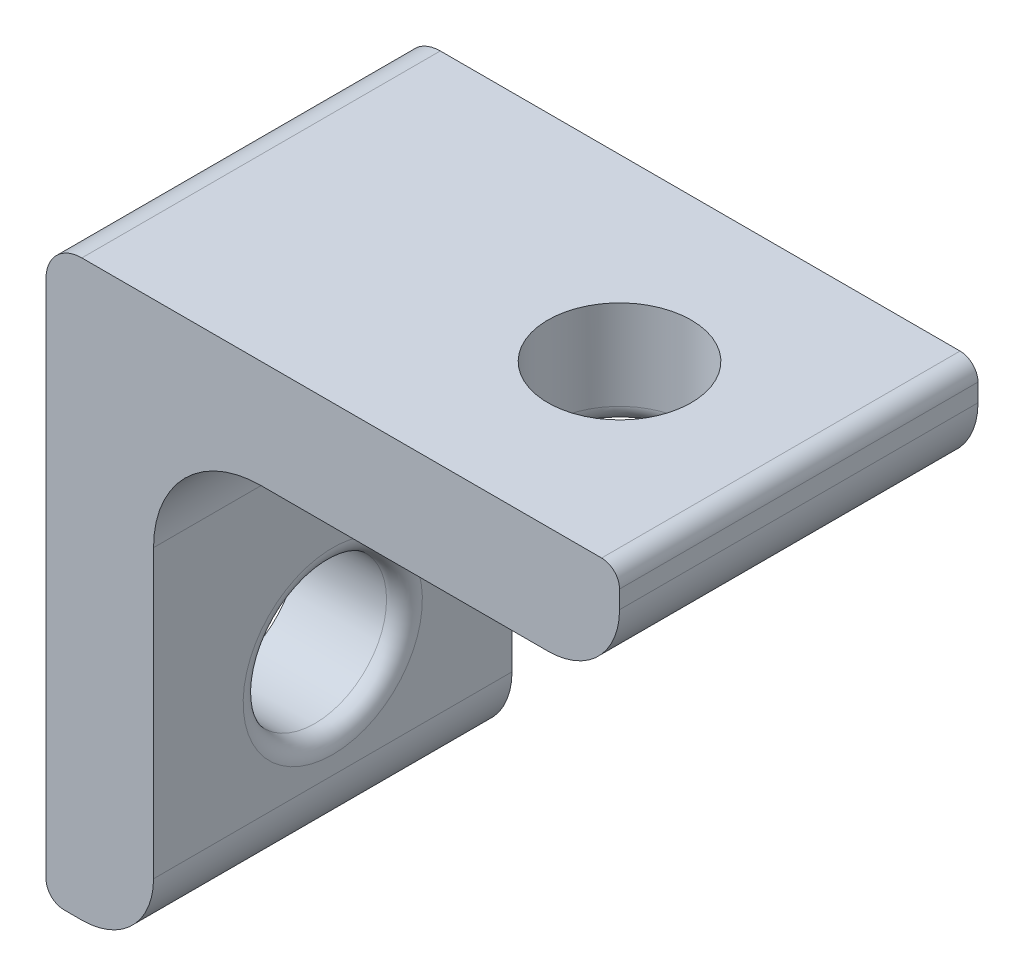
ISO-10303-21;
HEADER;
FILE_DESCRIPTION(('STEP AP214'),'2;1');
FILE_NAME('part.step','',(''),(''),'','','');
FILE_SCHEMA(('AUTOMOTIVE_DESIGN { 1 0 10303 214 1 1 1 1 }'));
ENDSEC;
DATA;
#1=APPLICATION_CONTEXT('core data for automotive mechanical design processes');
#2=APPLICATION_PROTOCOL_DEFINITION('international standard','automotive_design',2000,#1);
#3=PRODUCT_CONTEXT('',#1,'mechanical');
#4=PRODUCT('Part','Part','',(#3));
#5=PRODUCT_RELATED_PRODUCT_CATEGORY('part','',(#4));
#6=PRODUCT_DEFINITION_FORMATION('','',#4);
#7=PRODUCT_DEFINITION_CONTEXT('part definition',#1,'design');
#8=PRODUCT_DEFINITION('design','',#6,#7);
#9=PRODUCT_DEFINITION_SHAPE('','',#8);
#10=(LENGTH_UNIT() NAMED_UNIT(*) SI_UNIT(.MILLI.,.METRE.));
#11=(NAMED_UNIT(*) PLANE_ANGLE_UNIT() SI_UNIT($,.RADIAN.));
#12=(NAMED_UNIT(*) SI_UNIT($,.STERADIAN.) SOLID_ANGLE_UNIT());
#13=UNCERTAINTY_MEASURE_WITH_UNIT(LENGTH_MEASURE(1.E-05),#10,'distance_accuracy_value','');
#14=(GEOMETRIC_REPRESENTATION_CONTEXT(3) GLOBAL_UNCERTAINTY_ASSIGNED_CONTEXT((#13)) GLOBAL_UNIT_ASSIGNED_CONTEXT((#10,
#11,#12)) REPRESENTATION_CONTEXT('',''));
#15=CARTESIAN_POINT('',(0.,0.,0.));
#16=DIRECTION('',(0.,0.,1.));
#17=DIRECTION('',(1.,0.,0.));
#18=AXIS2_PLACEMENT_3D('',#15,#16,#17);
#19=CARTESIAN_POINT('',(-15.5,-12.5,10.));
#20=DIRECTION('',(0.,0.,-1.));
#21=DIRECTION('',(-1.,0.,0.));
#22=AXIS2_PLACEMENT_3D('',#19,#20,#21);
#23=CYLINDRICAL_SURFACE('',#22,0.500000000000001);
#24=CARTESIAN_POINT('',(-15.5,-12.5,0.));
#25=DIRECTION('',(0.,0.,1.));
#26=DIRECTION('',(1.,0.,0.));
#27=AXIS2_PLACEMENT_3D('',#24,#25,#26);
#28=CIRCLE('',#27,0.500000000000001);
#29=CARTESIAN_POINT('',(-16.,-12.5,0.));
#30=VERTEX_POINT('',#29);
#31=CARTESIAN_POINT('',(-15.5,-13.,0.));
#32=VERTEX_POINT('',#31);
#33=EDGE_CURVE('E154',#30,#32,#28,.T.);
#34=ORIENTED_EDGE('',*,*,#33,.T.);
#35=DIRECTION('',(0.,0.,-1.));
#36=VECTOR('',#35,1.);
#37=CARTESIAN_POINT('',(-15.5,-13.,10.));
#38=LINE('',#37,#36);
#39=CARTESIAN_POINT('',(-15.5,-13.,10.));
#40=VERTEX_POINT('',#39);
#41=EDGE_CURVE('E135',#40,#32,#38,.T.);
#42=ORIENTED_EDGE('',*,*,#41,.F.);
#43=CARTESIAN_POINT('',(-15.5,-12.5,10.));
#44=DIRECTION('',(0.,0.,1.));
#45=DIRECTION('',(1.,0.,0.));
#46=AXIS2_PLACEMENT_3D('',#43,#44,#45);
#47=CIRCLE('',#46,0.500000000000001);
#48=CARTESIAN_POINT('',(-16.,-12.5,10.));
#49=VERTEX_POINT('',#48);
#50=EDGE_CURVE('E142',#49,#40,#47,.T.);
#51=ORIENTED_EDGE('',*,*,#50,.F.);
#52=DIRECTION('',(0.,0.,-1.));
#53=VECTOR('',#52,1.);
#54=CARTESIAN_POINT('',(-16.,-12.5,10.));
#55=LINE('',#54,#53);
#56=EDGE_CURVE('E202',#49,#30,#55,.T.);
#57=ORIENTED_EDGE('',*,*,#56,.T.);
#58=EDGE_LOOP('',(#34,#42,#51,#57));
#59=FACE_BOUND('',#58,.T.);
#60=ADVANCED_FACE('F42',(#59),#23,.T.);
#61=CARTESIAN_POINT('',(-15.,-13.,10.));
#62=DIRECTION('',(0.,1.,0.));
#63=DIRECTION('',(-1.,0.,0.));
#64=AXIS2_PLACEMENT_3D('',#61,#62,#63);
#65=PLANE('',#64);
#66=DIRECTION('',(1.,0.,0.));
#67=VECTOR('',#66,1.);
#68=CARTESIAN_POINT('',(-15.,-13.,0.));
#69=LINE('',#68,#67);
#70=CARTESIAN_POINT('',(-15.,-13.,0.));
#71=VERTEX_POINT('',#70);
#72=EDGE_CURVE('E234',#32,#71,#69,.T.);
#73=ORIENTED_EDGE('',*,*,#72,.T.);
#74=DIRECTION('',(0.,0.,-1.));
#75=VECTOR('',#74,1.);
#76=CARTESIAN_POINT('',(-15.,-13.,10.));
#77=LINE('',#76,#75);
#78=CARTESIAN_POINT('',(-15.,-13.,10.));
#79=VERTEX_POINT('',#78);
#80=EDGE_CURVE('E138',#79,#71,#77,.T.);
#81=ORIENTED_EDGE('',*,*,#80,.F.);
#82=DIRECTION('',(1.,0.,0.));
#83=VECTOR('',#82,1.);
#84=CARTESIAN_POINT('',(-15.,-13.,10.));
#85=LINE('',#84,#83);
#86=EDGE_CURVE('E131',#40,#79,#85,.T.);
#87=ORIENTED_EDGE('',*,*,#86,.F.);
#88=ORIENTED_EDGE('',*,*,#41,.T.);
#89=EDGE_LOOP('',(#73,#81,#87,#88));
#90=FACE_BOUND('',#89,.T.);
#91=ADVANCED_FACE('F133',(#90),#65,.F.);
#92=CARTESIAN_POINT('',(-15.,-11.,10.));
#93=DIRECTION('',(0.,0.,-1.));
#94=DIRECTION('',(-1.,0.,0.));
#95=AXIS2_PLACEMENT_3D('',#92,#93,#94);
#96=CYLINDRICAL_SURFACE('',#95,2.);
#97=CARTESIAN_POINT('',(-15.,-11.,0.));
#98=DIRECTION('',(0.,0.,1.));
#99=DIRECTION('',(-1.,0.,0.));
#100=AXIS2_PLACEMENT_3D('',#97,#98,#99);
#101=CIRCLE('',#100,2.);
#102=CARTESIAN_POINT('',(-13.,-11.,0.));
#103=VERTEX_POINT('',#102);
#104=EDGE_CURVE('E228',#71,#103,#101,.T.);
#105=ORIENTED_EDGE('',*,*,#104,.T.);
#106=DIRECTION('',(0.,0.,-1.));
#107=VECTOR('',#106,1.);
#108=CARTESIAN_POINT('',(-13.,-11.,10.));
#109=LINE('',#108,#107);
#110=CARTESIAN_POINT('',(-13.,-11.,10.));
#111=VERTEX_POINT('',#110);
#112=EDGE_CURVE('E160',#111,#103,#109,.T.);
#113=ORIENTED_EDGE('',*,*,#112,.F.);
#114=CARTESIAN_POINT('',(-15.,-11.,10.));
#115=DIRECTION('',(0.,0.,1.));
#116=DIRECTION('',(-1.,0.,0.));
#117=AXIS2_PLACEMENT_3D('',#114,#115,#116);
#118=CIRCLE('',#117,2.);
#119=EDGE_CURVE('E141',#79,#111,#118,.T.);
#120=ORIENTED_EDGE('',*,*,#119,.F.);
#121=ORIENTED_EDGE('',*,*,#80,.T.);
#122=EDGE_LOOP('',(#105,#113,#120,#121));
#123=FACE_BOUND('',#122,.T.);
#124=ADVANCED_FACE('F256',(#123),#96,.T.);
#125=CARTESIAN_POINT('',(-13.,0.,10.));
#126=DIRECTION('',(-1.,0.,0.));
#127=DIRECTION('',(0.,-1.,0.));
#128=AXIS2_PLACEMENT_3D('',#125,#126,#127);
#129=PLANE('',#128);
#130=CARTESIAN_POINT('',(-13.,-8.00000000000001,5.));
#131=DIRECTION('',(-1.,0.,0.));
#132=DIRECTION('',(0.,-1.,0.));
#133=AXIS2_PLACEMENT_3D('',#130,#131,#132);
#134=CIRCLE('',#133,2.5);
#135=CARTESIAN_POINT('',(-13.,-10.5,5.));
#136=VERTEX_POINT('',#135);
#137=EDGE_CURVE('E175',#136,#136,#134,.T.);
#138=ORIENTED_EDGE('',*,*,#137,.T.);
#139=EDGE_LOOP('',(#138));
#140=FACE_BOUND('',#139,.T.);
#141=DIRECTION('',(0.,1.,0.));
#142=VECTOR('',#141,1.);
#143=CARTESIAN_POINT('',(-13.,0.,0.));
#144=LINE('',#143,#142);
#145=CARTESIAN_POINT('',(-13.,-3.,0.));
#146=VERTEX_POINT('',#145);
#147=EDGE_CURVE('E222',#103,#146,#144,.T.);
#148=ORIENTED_EDGE('',*,*,#147,.T.);
#149=DIRECTION('',(0.,0.,-1.));
#150=VECTOR('',#149,1.);
#151=CARTESIAN_POINT('',(-13.,-3.,10.));
#152=LINE('',#151,#150);
#153=CARTESIAN_POINT('',(-13.,-3.,10.));
#154=VERTEX_POINT('',#153);
#155=EDGE_CURVE('E181',#146,#154,#152,.F.);
#156=ORIENTED_EDGE('',*,*,#155,.T.);
#157=DIRECTION('',(0.,1.,0.));
#158=VECTOR('',#157,1.);
#159=CARTESIAN_POINT('',(-13.,0.,10.));
#160=LINE('',#159,#158);
#161=EDGE_CURVE('E225',#111,#154,#160,.T.);
#162=ORIENTED_EDGE('',*,*,#161,.F.);
#163=ORIENTED_EDGE('',*,*,#112,.T.);
#164=EDGE_LOOP('',(#148,#156,#162,#163));
#165=FACE_BOUND('',#164,.T.);
#166=ADVANCED_FACE('F221',(#140,#165),#129,.F.);
#167=CARTESIAN_POINT('',(-13.,0.,10.));
#168=DIRECTION('',(0.,1.,0.));
#169=DIRECTION('',(-1.,0.,0.));
#170=AXIS2_PLACEMENT_3D('',#167,#168,#169);
#171=PLANE('',#170);
#172=CARTESIAN_POINT('',(-5.,0.,5.));
#173=DIRECTION('',(0.,1.,0.));
#174=DIRECTION('',(-1.,0.,0.));
#175=AXIS2_PLACEMENT_3D('',#172,#173,#174);
#176=CIRCLE('',#175,2.5);
#177=CARTESIAN_POINT('',(-7.5,0.,5.));
#178=VERTEX_POINT('',#177);
#179=EDGE_CURVE('E155',#178,#178,#176,.T.);
#180=ORIENTED_EDGE('',*,*,#179,.T.);
#181=EDGE_LOOP('',(#180));
#182=FACE_BOUND('',#181,.T.);
#183=DIRECTION('',(1.,0.,0.));
#184=VECTOR('',#183,1.);
#185=CARTESIAN_POINT('',(-13.,0.,10.));
#186=LINE('',#185,#184);
#187=CARTESIAN_POINT('',(-10.,0.,10.));
#188=VERTEX_POINT('',#187);
#189=CARTESIAN_POINT('',(-2.00000000000001,0.,10.));
#190=VERTEX_POINT('',#189);
#191=EDGE_CURVE('E258',#188,#190,#186,.T.);
#192=ORIENTED_EDGE('',*,*,#191,.F.);
#193=DIRECTION('',(0.,0.,-1.));
#194=VECTOR('',#193,1.);
#195=CARTESIAN_POINT('',(-10.,0.,0.));
#196=LINE('',#195,#194);
#197=CARTESIAN_POINT('',(-10.,0.,0.));
#198=VERTEX_POINT('',#197);
#199=EDGE_CURVE('E178',#188,#198,#196,.T.);
#200=ORIENTED_EDGE('',*,*,#199,.T.);
#201=DIRECTION('',(1.,0.,0.));
#202=VECTOR('',#201,1.);
#203=CARTESIAN_POINT('',(-13.,0.,0.));
#204=LINE('',#203,#202);
#205=CARTESIAN_POINT('',(-2.00000000000001,0.,0.));
#206=VERTEX_POINT('',#205);
#207=EDGE_CURVE('E230',#198,#206,#204,.T.);
#208=ORIENTED_EDGE('',*,*,#207,.T.);
#209=DIRECTION('',(0.,0.,-1.));
#210=VECTOR('',#209,1.);
#211=CARTESIAN_POINT('',(-2.00000000000001,0.,10.));
#212=LINE('',#211,#210);
#213=EDGE_CURVE('E213',#190,#206,#212,.T.);
#214=ORIENTED_EDGE('',*,*,#213,.F.);
#215=EDGE_LOOP('',(#192,#200,#208,#214));
#216=FACE_BOUND('',#215,.T.);
#217=ADVANCED_FACE('F274',(#182,#216),#171,.F.);
#218=CARTESIAN_POINT('',(-2.,2.,10.));
#219=DIRECTION('',(0.,0.,-1.));
#220=DIRECTION('',(-1.,0.,0.));
#221=AXIS2_PLACEMENT_3D('',#218,#219,#220);
#222=CYLINDRICAL_SURFACE('',#221,2.);
#223=CARTESIAN_POINT('',(-2.,2.,0.));
#224=DIRECTION('',(0.,0.,1.));
#225=DIRECTION('',(-1.,0.,0.));
#226=AXIS2_PLACEMENT_3D('',#223,#224,#225);
#227=CIRCLE('',#226,2.);
#228=CARTESIAN_POINT('',(0.,2.00000000000001,0.));
#229=VERTEX_POINT('',#228);
#230=EDGE_CURVE('E232',#206,#229,#227,.T.);
#231=ORIENTED_EDGE('',*,*,#230,.T.);
#232=DIRECTION('',(0.,0.,-1.));
#233=VECTOR('',#232,1.);
#234=CARTESIAN_POINT('',(0.,2.00000000000001,10.));
#235=LINE('',#234,#233);
#236=CARTESIAN_POINT('',(0.,2.00000000000001,10.));
#237=VERTEX_POINT('',#236);
#238=EDGE_CURVE('E210',#237,#229,#235,.T.);
#239=ORIENTED_EDGE('',*,*,#238,.F.);
#240=CARTESIAN_POINT('',(-2.,2.,10.));
#241=DIRECTION('',(0.,0.,1.));
#242=DIRECTION('',(-1.,0.,0.));
#243=AXIS2_PLACEMENT_3D('',#240,#241,#242);
#244=CIRCLE('',#243,2.);
#245=EDGE_CURVE('E262',#190,#237,#244,.T.);
#246=ORIENTED_EDGE('',*,*,#245,.F.);
#247=ORIENTED_EDGE('',*,*,#213,.T.);
#248=EDGE_LOOP('',(#231,#239,#246,#247));
#249=FACE_BOUND('',#248,.T.);
#250=ADVANCED_FACE('F270',(#249),#222,.T.);
#251=CARTESIAN_POINT('',(0.,2.49999999999999,10.));
#252=DIRECTION('',(-1.,0.,0.));
#253=DIRECTION('',(0.,0.,1.));
#254=AXIS2_PLACEMENT_3D('',#251,#252,#253);
#255=PLANE('',#254);
#256=DIRECTION('',(0.,1.,0.));
#257=VECTOR('',#256,1.);
#258=CARTESIAN_POINT('',(0.,2.49999999999999,0.));
#259=LINE('',#258,#257);
#260=CARTESIAN_POINT('',(0.,2.49999999999999,0.));
#261=VERTEX_POINT('',#260);
#262=EDGE_CURVE('E239',#229,#261,#259,.T.);
#263=ORIENTED_EDGE('',*,*,#262,.T.);
#264=DIRECTION('',(0.,0.,-1.));
#265=VECTOR('',#264,1.);
#266=CARTESIAN_POINT('',(0.,2.49999999999999,10.));
#267=LINE('',#266,#265);
#268=CARTESIAN_POINT('',(0.,2.49999999999999,10.));
#269=VERTEX_POINT('',#268);
#270=EDGE_CURVE('E207',#269,#261,#267,.T.);
#271=ORIENTED_EDGE('',*,*,#270,.F.);
#272=DIRECTION('',(0.,1.,0.));
#273=VECTOR('',#272,1.);
#274=CARTESIAN_POINT('',(0.,2.49999999999999,10.));
#275=LINE('',#274,#273);
#276=EDGE_CURVE('E252',#237,#269,#275,.T.);
#277=ORIENTED_EDGE('',*,*,#276,.F.);
#278=ORIENTED_EDGE('',*,*,#238,.T.);
#279=EDGE_LOOP('',(#263,#271,#277,#278));
#280=FACE_BOUND('',#279,.T.);
#281=ADVANCED_FACE('F267',(#280),#255,.F.);
#282=CARTESIAN_POINT('',(-0.5,2.5,10.));
#283=DIRECTION('',(0.,0.,-1.));
#284=DIRECTION('',(-1.,0.,0.));
#285=AXIS2_PLACEMENT_3D('',#282,#283,#284);
#286=CYLINDRICAL_SURFACE('',#285,0.5);
#287=CARTESIAN_POINT('',(-0.5,2.5,0.));
#288=DIRECTION('',(0.,0.,1.));
#289=DIRECTION('',(1.,0.,0.));
#290=AXIS2_PLACEMENT_3D('',#287,#288,#289);
#291=CIRCLE('',#290,0.5);
#292=CARTESIAN_POINT('',(-0.500000000000004,3.,0.));
#293=VERTEX_POINT('',#292);
#294=EDGE_CURVE('E198',#261,#293,#291,.T.);
#295=ORIENTED_EDGE('',*,*,#294,.T.);
#296=DIRECTION('',(0.,0.,-1.));
#297=VECTOR('',#296,1.);
#298=CARTESIAN_POINT('',(-0.500000000000004,3.,10.));
#299=LINE('',#298,#297);
#300=CARTESIAN_POINT('',(-0.500000000000004,3.,10.));
#301=VERTEX_POINT('',#300);
#302=EDGE_CURVE('E204',#301,#293,#299,.T.);
#303=ORIENTED_EDGE('',*,*,#302,.F.);
#304=CARTESIAN_POINT('',(-0.5,2.5,10.));
#305=DIRECTION('',(0.,0.,1.));
#306=DIRECTION('',(1.,0.,0.));
#307=AXIS2_PLACEMENT_3D('',#304,#305,#306);
#308=CIRCLE('',#307,0.5);
#309=EDGE_CURVE('E249',#269,#301,#308,.T.);
#310=ORIENTED_EDGE('',*,*,#309,.F.);
#311=ORIENTED_EDGE('',*,*,#270,.T.);
#312=EDGE_LOOP('',(#295,#303,#310,#311));
#313=FACE_BOUND('',#312,.T.);
#314=ADVANCED_FACE('F243',(#313),#286,.T.);
#315=CARTESIAN_POINT('',(-16.,3.,10.));
#316=DIRECTION('',(0.,-1.,0.));
#317=DIRECTION('',(0.,0.,-1.));
#318=AXIS2_PLACEMENT_3D('',#315,#316,#317);
#319=PLANE('',#318);
#320=CARTESIAN_POINT('',(-5.,3.,5.));
#321=DIRECTION('',(0.,-1.,0.));
#322=DIRECTION('',(0.,0.,-1.));
#323=AXIS2_PLACEMENT_3D('',#320,#321,#322);
#324=CIRCLE('',#323,2.);
#325=CARTESIAN_POINT('',(-5.,3.,3.));
#326=VERTEX_POINT('',#325);
#327=EDGE_CURVE('E164',#326,#326,#324,.F.);
#328=ORIENTED_EDGE('',*,*,#327,.F.);
#329=EDGE_LOOP('',(#328));
#330=FACE_BOUND('',#329,.T.);
#331=DIRECTION('',(-1.,0.,0.));
#332=VECTOR('',#331,1.);
#333=CARTESIAN_POINT('',(-16.,3.,0.));
#334=LINE('',#333,#332);
#335=CARTESIAN_POINT('',(-15.,3.,0.));
#336=VERTEX_POINT('',#335);
#337=EDGE_CURVE('E196',#293,#336,#334,.T.);
#338=ORIENTED_EDGE('',*,*,#337,.T.);
#339=DIRECTION('',(0.,0.,-1.));
#340=VECTOR('',#339,1.);
#341=CARTESIAN_POINT('',(-15.,3.,10.));
#342=LINE('',#341,#340);
#343=CARTESIAN_POINT('',(-15.,3.,10.));
#344=VERTEX_POINT('',#343);
#345=EDGE_CURVE('E50',#336,#344,#342,.F.);
#346=ORIENTED_EDGE('',*,*,#345,.T.);
#347=DIRECTION('',(-1.,0.,0.));
#348=VECTOR('',#347,1.);
#349=CARTESIAN_POINT('',(-16.,3.,10.));
#350=LINE('',#349,#348);
#351=EDGE_CURVE('E248',#301,#344,#350,.T.);
#352=ORIENTED_EDGE('',*,*,#351,.F.);
#353=ORIENTED_EDGE('',*,*,#302,.T.);
#354=EDGE_LOOP('',(#338,#346,#352,#353));
#355=FACE_BOUND('',#354,.T.);
#356=ADVANCED_FACE('F247',(#330,#355),#319,.F.);
#357=CARTESIAN_POINT('',(-16.,-12.5,10.));
#358=DIRECTION('',(1.,0.,0.));
#359=DIRECTION('',(0.,0.,-1.));
#360=AXIS2_PLACEMENT_3D('',#357,#358,#359);
#361=PLANE('',#360);
#362=CARTESIAN_POINT('',(-16.,-8.00000000000001,5.));
#363=DIRECTION('',(1.,0.,0.));
#364=DIRECTION('',(0.,0.,-1.));
#365=AXIS2_PLACEMENT_3D('',#362,#363,#364);
#366=CIRCLE('',#365,2.);
#367=CARTESIAN_POINT('',(-16.,-8.00000000000001,3.));
#368=VERTEX_POINT('',#367);
#369=EDGE_CURVE('E167',#368,#368,#366,.T.);
#370=ORIENTED_EDGE('',*,*,#369,.T.);
#371=EDGE_LOOP('',(#370));
#372=FACE_BOUND('',#371,.T.);
#373=DIRECTION('',(0.,-1.,0.));
#374=VECTOR('',#373,1.);
#375=CARTESIAN_POINT('',(-16.,-12.5,10.));
#376=LINE('',#375,#374);
#377=CARTESIAN_POINT('',(-16.,2.,10.));
#378=VERTEX_POINT('',#377);
#379=EDGE_CURVE('E147',#378,#49,#376,.T.);
#380=ORIENTED_EDGE('',*,*,#379,.F.);
#381=DIRECTION('',(0.,0.,-1.));
#382=VECTOR('',#381,1.);
#383=CARTESIAN_POINT('',(-16.,2.,10.));
#384=LINE('',#383,#382);
#385=CARTESIAN_POINT('',(-16.,2.,0.));
#386=VERTEX_POINT('',#385);
#387=EDGE_CURVE('E187',#378,#386,#384,.T.);
#388=ORIENTED_EDGE('',*,*,#387,.T.);
#389=DIRECTION('',(0.,-1.,0.));
#390=VECTOR('',#389,1.);
#391=CARTESIAN_POINT('',(-16.,-12.5,0.));
#392=LINE('',#391,#390);
#393=EDGE_CURVE('E151',#386,#30,#392,.T.);
#394=ORIENTED_EDGE('',*,*,#393,.T.);
#395=ORIENTED_EDGE('',*,*,#56,.F.);
#396=EDGE_LOOP('',(#380,#388,#394,#395));
#397=FACE_BOUND('',#396,.T.);
#398=ADVANCED_FACE('F192',(#372,#397),#361,.F.);
#399=CARTESIAN_POINT('',(-15.5,-12.5,10.));
#400=DIRECTION('',(0.,0.,1.));
#401=DIRECTION('',(1.,0.,0.));
#402=AXIS2_PLACEMENT_3D('',#399,#400,#401);
#403=PLANE('',#402);
#404=ORIENTED_EDGE('',*,*,#351,.T.);
#405=CARTESIAN_POINT('',(-15.,2.,10.));
#406=DIRECTION('',(0.,0.,1.));
#407=DIRECTION('',(1.,0.,0.));
#408=AXIS2_PLACEMENT_3D('',#405,#406,#407);
#409=CIRCLE('',#408,1.);
#410=EDGE_CURVE('E12',#344,#378,#409,.T.);
#411=ORIENTED_EDGE('',*,*,#410,.T.);
#412=ORIENTED_EDGE('',*,*,#379,.T.);
#413=ORIENTED_EDGE('',*,*,#50,.T.);
#414=ORIENTED_EDGE('',*,*,#86,.T.);
#415=ORIENTED_EDGE('',*,*,#119,.T.);
#416=ORIENTED_EDGE('',*,*,#161,.T.);
#417=CARTESIAN_POINT('',(-10.,-3.,10.));
#418=DIRECTION('',(0.,0.,1.));
#419=DIRECTION('',(1.,0.,0.));
#420=AXIS2_PLACEMENT_3D('',#417,#418,#419);
#421=CIRCLE('',#420,3.);
#422=EDGE_CURVE('E185',#154,#188,#421,.F.);
#423=ORIENTED_EDGE('',*,*,#422,.T.);
#424=ORIENTED_EDGE('',*,*,#191,.T.);
#425=ORIENTED_EDGE('',*,*,#245,.T.);
#426=ORIENTED_EDGE('',*,*,#276,.T.);
#427=ORIENTED_EDGE('',*,*,#309,.T.);
#428=EDGE_LOOP('',(#404,#411,#412,#413,#414,#415,#416,#423,#424,#425,#426,#427));
#429=FACE_BOUND('',#428,.T.);
#430=ADVANCED_FACE('F145',(#429),#403,.T.);
#431=CARTESIAN_POINT('',(-15.5,-12.5,0.));
#432=DIRECTION('',(0.,0.,1.));
#433=DIRECTION('',(1.,0.,0.));
#434=AXIS2_PLACEMENT_3D('',#431,#432,#433);
#435=PLANE('',#434);
#436=ORIENTED_EDGE('',*,*,#393,.F.);
#437=CARTESIAN_POINT('',(-15.,2.,0.));
#438=DIRECTION('',(0.,0.,1.));
#439=DIRECTION('',(1.,0.,0.));
#440=AXIS2_PLACEMENT_3D('',#437,#438,#439);
#441=CIRCLE('',#440,1.);
#442=EDGE_CURVE('E64',#386,#336,#441,.F.);
#443=ORIENTED_EDGE('',*,*,#442,.T.);
#444=ORIENTED_EDGE('',*,*,#337,.F.);
#445=ORIENTED_EDGE('',*,*,#294,.F.);
#446=ORIENTED_EDGE('',*,*,#262,.F.);
#447=ORIENTED_EDGE('',*,*,#230,.F.);
#448=ORIENTED_EDGE('',*,*,#207,.F.);
#449=CARTESIAN_POINT('',(-10.,-3.,0.));
#450=DIRECTION('',(0.,0.,1.));
#451=DIRECTION('',(1.,0.,0.));
#452=AXIS2_PLACEMENT_3D('',#449,#450,#451);
#453=CIRCLE('',#452,3.);
#454=EDGE_CURVE('E183',#198,#146,#453,.T.);
#455=ORIENTED_EDGE('',*,*,#454,.T.);
#456=ORIENTED_EDGE('',*,*,#147,.F.);
#457=ORIENTED_EDGE('',*,*,#104,.F.);
#458=ORIENTED_EDGE('',*,*,#72,.F.);
#459=ORIENTED_EDGE('',*,*,#33,.F.);
#460=EDGE_LOOP('',(#436,#443,#444,#445,#446,#447,#448,#455,#456,#457,#458,#459));
#461=FACE_BOUND('',#460,.T.);
#462=ADVANCED_FACE('F195',(#461),#435,.F.);
#463=CARTESIAN_POINT('',(-5.,10.,5.));
#464=DIRECTION('',(0.,-1.,0.));
#465=DIRECTION('',(0.,0.,-1.));
#466=AXIS2_PLACEMENT_3D('',#463,#464,#465);
#467=CYLINDRICAL_SURFACE('',#466,2.);
#468=CARTESIAN_POINT('',(-5.,0.5,5.));
#469=DIRECTION('',(0.,1.,0.));
#470=DIRECTION('',(-1.,0.,0.));
#471=AXIS2_PLACEMENT_3D('',#468,#469,#470);
#472=CIRCLE('',#471,2.);
#473=CARTESIAN_POINT('',(-7.,0.5,5.));
#474=VERTEX_POINT('',#473);
#475=EDGE_CURVE('E158',#474,#474,#472,.F.);
#476=ORIENTED_EDGE('',*,*,#475,.T.);
#477=EDGE_LOOP('',(#476));
#478=FACE_BOUND('',#477,.T.);
#479=ORIENTED_EDGE('',*,*,#327,.T.);
#480=EDGE_LOOP('',(#479));
#481=FACE_BOUND('',#480,.T.);
#482=ADVANCED_FACE('F302',(#478,#481),#467,.F.);
#483=CARTESIAN_POINT('',(-33.,-8.00000000000001,5.));
#484=DIRECTION('',(1.,0.,0.));
#485=DIRECTION('',(0.,0.,-1.));
#486=AXIS2_PLACEMENT_3D('',#483,#484,#485);
#487=CYLINDRICAL_SURFACE('',#486,2.);
#488=CARTESIAN_POINT('',(-13.5,-8.00000000000001,5.));
#489=DIRECTION('',(-1.,0.,0.));
#490=DIRECTION('',(0.,-1.,0.));
#491=AXIS2_PLACEMENT_3D('',#488,#489,#490);
#492=CIRCLE('',#491,2.);
#493=CARTESIAN_POINT('',(-13.5,-10.,5.));
#494=VERTEX_POINT('',#493);
#495=EDGE_CURVE('E172',#494,#494,#492,.F.);
#496=ORIENTED_EDGE('',*,*,#495,.T.);
#497=EDGE_LOOP('',(#496));
#498=FACE_BOUND('',#497,.T.);
#499=ORIENTED_EDGE('',*,*,#369,.F.);
#500=EDGE_LOOP('',(#499));
#501=FACE_BOUND('',#500,.T.);
#502=ADVANCED_FACE('F297',(#498,#501),#487,.F.);
#503=CARTESIAN_POINT('',(-5.,0.5,5.));
#504=DIRECTION('',(0.,1.,0.));
#505=DIRECTION('',(-1.,0.,0.));
#506=AXIS2_PLACEMENT_3D('',#503,#504,#505);
#507=TOROIDAL_SURFACE('',#506,2.5,0.5);
#508=ORIENTED_EDGE('',*,*,#475,.F.);
#509=EDGE_LOOP('',(#508));
#510=FACE_BOUND('',#509,.T.);
#511=ORIENTED_EDGE('',*,*,#179,.F.);
#512=EDGE_LOOP('',(#511));
#513=FACE_BOUND('',#512,.T.);
#514=ADVANCED_FACE('F285',(#510,#513),#507,.T.);
#515=CARTESIAN_POINT('',(-13.5,-8.00000000000001,5.));
#516=DIRECTION('',(-1.,0.,0.));
#517=DIRECTION('',(0.,-1.,0.));
#518=AXIS2_PLACEMENT_3D('',#515,#516,#517);
#519=TOROIDAL_SURFACE('',#518,2.5,0.5);
#520=ORIENTED_EDGE('',*,*,#137,.F.);
#521=EDGE_LOOP('',(#520));
#522=FACE_BOUND('',#521,.T.);
#523=ORIENTED_EDGE('',*,*,#495,.F.);
#524=EDGE_LOOP('',(#523));
#525=FACE_BOUND('',#524,.T.);
#526=ADVANCED_FACE('F280',(#522,#525),#519,.T.);
#527=CARTESIAN_POINT('',(-10.,-3.,10.));
#528=DIRECTION('',(0.,0.,1.));
#529=DIRECTION('',(1.,0.,0.));
#530=AXIS2_PLACEMENT_3D('',#527,#528,#529);
#531=CYLINDRICAL_SURFACE('',#530,3.);
#532=ORIENTED_EDGE('',*,*,#422,.F.);
#533=ORIENTED_EDGE('',*,*,#155,.F.);
#534=ORIENTED_EDGE('',*,*,#454,.F.);
#535=ORIENTED_EDGE('',*,*,#199,.F.);
#536=EDGE_LOOP('',(#532,#533,#534,#535));
#537=FACE_BOUND('',#536,.T.);
#538=ADVANCED_FACE('F278',(#537),#531,.F.);
#539=CARTESIAN_POINT('',(-15.,2.,10.));
#540=DIRECTION('',(0.,0.,-1.));
#541=DIRECTION('',(-1.,0.,0.));
#542=AXIS2_PLACEMENT_3D('',#539,#540,#541);
#543=CYLINDRICAL_SURFACE('',#542,1.);
#544=ORIENTED_EDGE('',*,*,#410,.F.);
#545=ORIENTED_EDGE('',*,*,#345,.F.);
#546=ORIENTED_EDGE('',*,*,#442,.F.);
#547=ORIENTED_EDGE('',*,*,#387,.F.);
#548=EDGE_LOOP('',(#544,#545,#546,#547));
#549=FACE_BOUND('',#548,.T.);
#550=ADVANCED_FACE('F44',(#549),#543,.T.);
#551=CLOSED_SHELL('',(#60,#91,#124,#166,#217,#250,#281,#314,#356,#398,#430,#462,#482,#502,#514,
#526,#538,#550));
#552=MANIFOLD_SOLID_BREP('B2',#551);
#553=ADVANCED_BREP_SHAPE_REPRESENTATION('',(#18,#552),#14);
#554=SHAPE_DEFINITION_REPRESENTATION(#9,#553);
ENDSEC;
END-ISO-10303-21;
